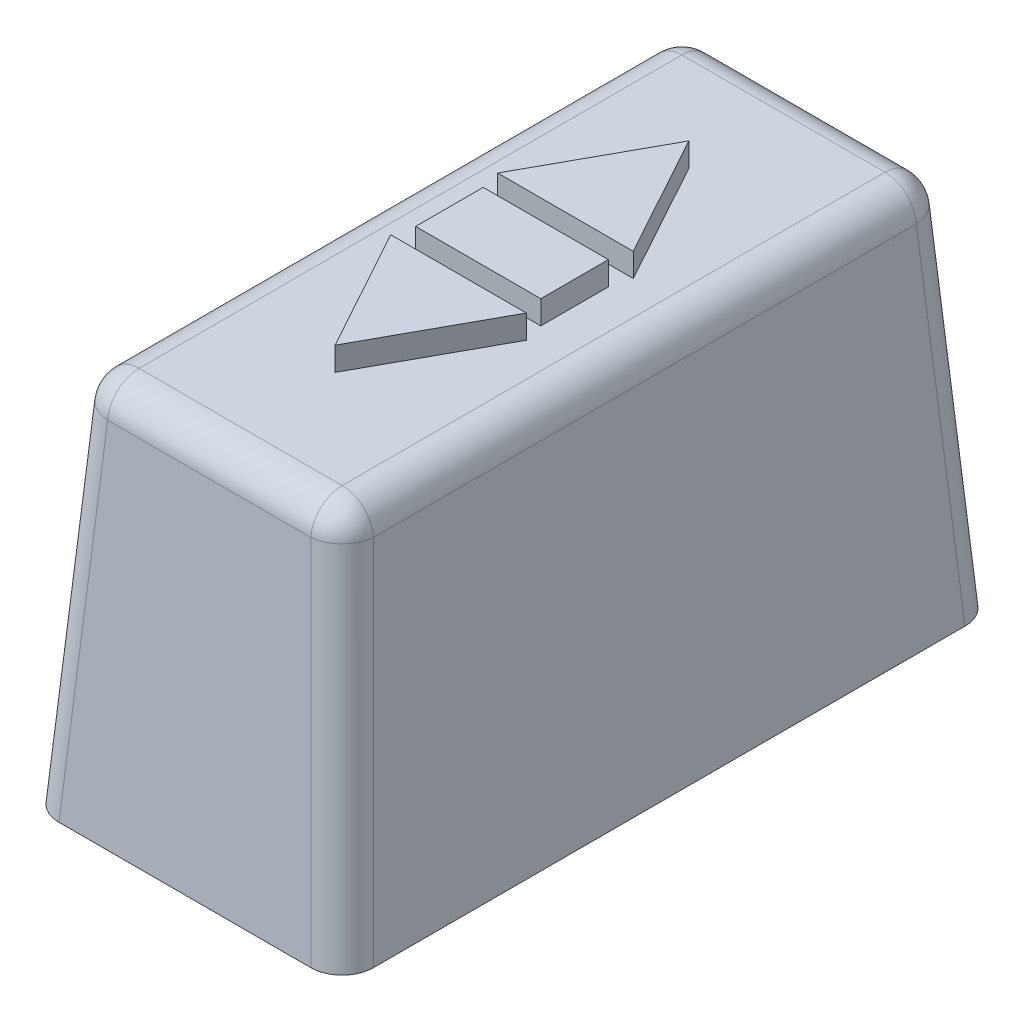
ISO-10303-21;
HEADER;
FILE_DESCRIPTION(('STEP AP214'),'2;1');
FILE_NAME('part.step','',(''),(''),'','','');
FILE_SCHEMA(('AUTOMOTIVE_DESIGN { 1 0 10303 214 1 1 1 1 }'));
ENDSEC;
DATA;
#1=APPLICATION_CONTEXT('core data for automotive mechanical design processes');
#2=APPLICATION_PROTOCOL_DEFINITION('international standard','automotive_design',2000,#1);
#3=PRODUCT_CONTEXT('',#1,'mechanical');
#4=PRODUCT('Part','Part','',(#3));
#5=PRODUCT_RELATED_PRODUCT_CATEGORY('part','',(#4));
#6=PRODUCT_DEFINITION_FORMATION('','',#4);
#7=PRODUCT_DEFINITION_CONTEXT('part definition',#1,'design');
#8=PRODUCT_DEFINITION('design','',#6,#7);
#9=PRODUCT_DEFINITION_SHAPE('','',#8);
#10=(LENGTH_UNIT() NAMED_UNIT(*) SI_UNIT(.MILLI.,.METRE.));
#11=(NAMED_UNIT(*) PLANE_ANGLE_UNIT() SI_UNIT($,.RADIAN.));
#12=(NAMED_UNIT(*) SI_UNIT($,.STERADIAN.) SOLID_ANGLE_UNIT());
#13=UNCERTAINTY_MEASURE_WITH_UNIT(LENGTH_MEASURE(1.E-05),#10,'distance_accuracy_value','');
#14=(GEOMETRIC_REPRESENTATION_CONTEXT(3) GLOBAL_UNCERTAINTY_ASSIGNED_CONTEXT((#13)) GLOBAL_UNIT_ASSIGNED_CONTEXT((#10,
#11,#12)) REPRESENTATION_CONTEXT('',''));
#15=CARTESIAN_POINT('',(0.,0.,0.));
#16=DIRECTION('',(0.,0.,1.));
#17=DIRECTION('',(1.,0.,0.));
#18=AXIS2_PLACEMENT_3D('',#15,#16,#17);
#19=CARTESIAN_POINT('',(0.,48.,0.));
#20=DIRECTION('',(0.,1.,0.));
#21=DIRECTION('',(0.,0.,1.));
#22=AXIS2_PLACEMENT_3D('',#19,#20,#21);
#23=PLANE('',#22);
#24=DIRECTION('',(0.,0.,1.));
#25=VECTOR('',#24,1.);
#26=CARTESIAN_POINT('',(12.9134526821608,48.,0.));
#27=LINE('',#26,#25);
#28=CARTESIAN_POINT('',(12.9134526821608,48.,34.5134526821608));
#29=VERTEX_POINT('',#28);
#30=CARTESIAN_POINT('',(12.9134526821608,48.,-34.5134526821608));
#31=VERTEX_POINT('',#30);
#32=EDGE_CURVE('E310',#29,#31,#27,.F.);
#33=ORIENTED_EDGE('',*,*,#32,.T.);
#34=DIRECTION('',(1.,0.,0.));
#35=VECTOR('',#34,1.);
#36=CARTESIAN_POINT('',(0.,48.,-34.5134526821608));
#37=LINE('',#36,#35);
#38=CARTESIAN_POINT('',(-12.9134526821608,48.,-34.5134526821608));
#39=VERTEX_POINT('',#38);
#40=EDGE_CURVE('E319',#31,#39,#37,.F.);
#41=ORIENTED_EDGE('',*,*,#40,.T.);
#42=DIRECTION('',(0.,0.,1.));
#43=VECTOR('',#42,1.);
#44=CARTESIAN_POINT('',(-12.9134526821608,48.,0.));
#45=LINE('',#44,#43);
#46=CARTESIAN_POINT('',(-12.9134526821608,48.,34.5134526821608));
#47=VERTEX_POINT('',#46);
#48=EDGE_CURVE('E316',#39,#47,#45,.T.);
#49=ORIENTED_EDGE('',*,*,#48,.T.);
#50=DIRECTION('',(1.,0.,0.));
#51=VECTOR('',#50,1.);
#52=CARTESIAN_POINT('',(0.,48.,34.5134526821608));
#53=LINE('',#52,#51);
#54=EDGE_CURVE('E313',#47,#29,#53,.T.);
#55=ORIENTED_EDGE('',*,*,#54,.T.);
#56=EDGE_LOOP('',(#33,#41,#49,#55));
#57=FACE_BOUND('',#56,.T.);
#58=DIRECTION('',(0.,0.,-1.));
#59=VECTOR('',#58,1.);
#60=CARTESIAN_POINT('',(-7.95831378719474,48.,0.));
#61=LINE('',#60,#59);
#62=CARTESIAN_POINT('',(-7.95831378719474,48.,4.3));
#63=VERTEX_POINT('',#62);
#64=CARTESIAN_POINT('',(-7.95831378719474,48.,-4.3));
#65=VERTEX_POINT('',#64);
#66=EDGE_CURVE('E199',#63,#65,#61,.T.);
#67=ORIENTED_EDGE('',*,*,#66,.T.);
#68=DIRECTION('',(-1.,0.,0.));
#69=VECTOR('',#68,1.);
#70=CARTESIAN_POINT('',(0.,48.,-4.3));
#71=LINE('',#70,#69);
#72=CARTESIAN_POINT('',(7.95831378719474,48.,-4.3));
#73=VERTEX_POINT('',#72);
#74=EDGE_CURVE('E240',#73,#65,#71,.T.);
#75=ORIENTED_EDGE('',*,*,#74,.F.);
#76=DIRECTION('',(0.,0.,-1.));
#77=VECTOR('',#76,1.);
#78=CARTESIAN_POINT('',(7.95831378719474,48.,0.));
#79=LINE('',#78,#77);
#80=CARTESIAN_POINT('',(7.95831378719474,48.,4.3));
#81=VERTEX_POINT('',#80);
#82=EDGE_CURVE('E244',#81,#73,#79,.T.);
#83=ORIENTED_EDGE('',*,*,#82,.F.);
#84=DIRECTION('',(-1.,0.,0.));
#85=VECTOR('',#84,1.);
#86=CARTESIAN_POINT('',(0.,48.,4.3));
#87=LINE('',#86,#85);
#88=EDGE_CURVE('E226',#81,#63,#87,.T.);
#89=ORIENTED_EDGE('',*,*,#88,.T.);
#90=EDGE_LOOP('',(#67,#75,#83,#89));
#91=FACE_BOUND('',#90,.T.);
#92=DIRECTION('',(0.481298204333065,0.,-0.876556922570216));
#93=VECTOR('',#92,1.);
#94=CARTESIAN_POINT('',(-9.49241863864714,48.,-5.21207913362023));
#95=LINE('',#94,#93);
#96=CARTESIAN_POINT('',(-8.62052607590218,48.,-6.8));
#97=VERTEX_POINT('',#96);
#98=CARTESIAN_POINT('',(0.,48.,-22.5));
#99=VERTEX_POINT('',#98);
#100=EDGE_CURVE('E254',#97,#99,#95,.T.);
#101=ORIENTED_EDGE('',*,*,#100,.T.);
#102=DIRECTION('',(0.481298204333064,0.,0.876556922570216));
#103=VECTOR('',#102,1.);
#104=CARTESIAN_POINT('',(9.49241863864715,48.,-5.21207913362023));
#105=LINE('',#104,#103);
#106=CARTESIAN_POINT('',(8.62052607590218,48.,-6.8));
#107=VERTEX_POINT('',#106);
#108=EDGE_CURVE('E279',#99,#107,#105,.T.);
#109=ORIENTED_EDGE('',*,*,#108,.T.);
#110=DIRECTION('',(-1.,0.,0.));
#111=VECTOR('',#110,1.);
#112=CARTESIAN_POINT('',(0.,48.,-6.8));
#113=LINE('',#112,#111);
#114=EDGE_CURVE('E268',#107,#97,#113,.T.);
#115=ORIENTED_EDGE('',*,*,#114,.T.);
#116=EDGE_LOOP('',(#101,#109,#115));
#117=FACE_BOUND('',#116,.T.);
#118=DIRECTION('',(-0.481298204333065,0.,-0.876556922570216));
#119=VECTOR('',#118,1.);
#120=CARTESIAN_POINT('',(-9.49241863864714,48.,5.21207913362023));
#121=LINE('',#120,#119);
#122=CARTESIAN_POINT('',(0.,48.,22.5));
#123=VERTEX_POINT('',#122);
#124=CARTESIAN_POINT('',(-8.62052607590217,48.,6.8));
#125=VERTEX_POINT('',#124);
#126=EDGE_CURVE('E212',#123,#125,#121,.T.);
#127=ORIENTED_EDGE('',*,*,#126,.T.);
#128=DIRECTION('',(-1.,0.,0.));
#129=VECTOR('',#128,1.);
#130=CARTESIAN_POINT('',(0.,48.,6.8));
#131=LINE('',#130,#129);
#132=CARTESIAN_POINT('',(8.62052607590218,48.,6.8));
#133=VERTEX_POINT('',#132);
#134=EDGE_CURVE('E195',#133,#125,#131,.T.);
#135=ORIENTED_EDGE('',*,*,#134,.F.);
#136=DIRECTION('',(-0.481298204333064,0.,0.876556922570216));
#137=VECTOR('',#136,1.);
#138=CARTESIAN_POINT('',(9.49241863864715,48.,5.21207913362023));
#139=LINE('',#138,#137);
#140=EDGE_CURVE('E189',#133,#123,#139,.T.);
#141=ORIENTED_EDGE('',*,*,#140,.T.);
#142=EDGE_LOOP('',(#127,#135,#141));
#143=FACE_BOUND('',#142,.T.);
#144=ADVANCED_FACE('F41',(#57,#91,#117,#143),#23,.T.);
#145=CARTESIAN_POINT('',(0.,0.,0.));
#146=DIRECTION('',(0.,1.,0.));
#147=DIRECTION('',(0.,0.,1.));
#148=AXIS2_PLACEMENT_3D('',#145,#146,#147);
#149=PLANE('',#148);
#150=DIRECTION('',(1.,0.,0.));
#151=VECTOR('',#150,1.);
#152=CARTESIAN_POINT('',(0.,0.,-41.6));
#153=LINE('',#152,#151);
#154=CARTESIAN_POINT('',(-16.0097437989605,0.,-41.6));
#155=VERTEX_POINT('',#154);
#156=CARTESIAN_POINT('',(16.0097437989605,0.,-41.6));
#157=VERTEX_POINT('',#156);
#158=EDGE_CURVE('E299',#155,#157,#153,.T.);
#159=ORIENTED_EDGE('',*,*,#158,.T.);
#160=CARTESIAN_POINT('',(15.9902324076752,0.,-37.5902324076751));
#161=DIRECTION('',(0.,1.,0.));
#162=DIRECTION('',(-0.707106781186548,0.,0.707106781186548));
#163=AXIS2_PLACEMENT_3D('',#160,#161,#162);
#164=ELLIPSE('',#163,4.01951144903391,4.);
#165=CARTESIAN_POINT('',(20.,0.,-37.6097437989605));
#166=VERTEX_POINT('',#165);
#167=EDGE_CURVE('E351',#157,#166,#164,.F.);
#168=ORIENTED_EDGE('',*,*,#167,.T.);
#169=DIRECTION('',(0.,0.,1.));
#170=VECTOR('',#169,1.);
#171=CARTESIAN_POINT('',(20.,0.,0.));
#172=LINE('',#171,#170);
#173=CARTESIAN_POINT('',(20.,0.,37.6097437989605));
#174=VERTEX_POINT('',#173);
#175=EDGE_CURVE('E288',#166,#174,#172,.T.);
#176=ORIENTED_EDGE('',*,*,#175,.T.);
#177=CARTESIAN_POINT('',(15.9902324076752,0.,37.5902324076751));
#178=DIRECTION('',(0.,1.,0.));
#179=DIRECTION('',(0.707106781186548,0.,0.707106781186548));
#180=AXIS2_PLACEMENT_3D('',#177,#178,#179);
#181=ELLIPSE('',#180,4.01951144903391,4.);
#182=CARTESIAN_POINT('',(16.0097437989605,0.,41.6));
#183=VERTEX_POINT('',#182);
#184=EDGE_CURVE('E342',#174,#183,#181,.F.);
#185=ORIENTED_EDGE('',*,*,#184,.T.);
#186=DIRECTION('',(1.,0.,0.));
#187=VECTOR('',#186,1.);
#188=CARTESIAN_POINT('',(0.,0.,41.6));
#189=LINE('',#188,#187);
#190=CARTESIAN_POINT('',(-16.0097437989605,0.,41.6));
#191=VERTEX_POINT('',#190);
#192=EDGE_CURVE('E307',#191,#183,#189,.T.);
#193=ORIENTED_EDGE('',*,*,#192,.F.);
#194=CARTESIAN_POINT('',(-15.9902324076751,0.,37.5902324076751));
#195=DIRECTION('',(0.,1.,0.));
#196=DIRECTION('',(-0.707106781186548,0.,0.707106781186548));
#197=AXIS2_PLACEMENT_3D('',#194,#195,#196);
#198=ELLIPSE('',#197,4.01951144903391,4.);
#199=CARTESIAN_POINT('',(-20.,0.,37.6097437989605));
#200=VERTEX_POINT('',#199);
#201=EDGE_CURVE('E345',#191,#200,#198,.F.);
#202=ORIENTED_EDGE('',*,*,#201,.T.);
#203=DIRECTION('',(0.,0.,1.));
#204=VECTOR('',#203,1.);
#205=CARTESIAN_POINT('',(-20.,0.,0.));
#206=LINE('',#205,#204);
#207=CARTESIAN_POINT('',(-20.,0.,-37.6097437989605));
#208=VERTEX_POINT('',#207);
#209=EDGE_CURVE('E303',#208,#200,#206,.T.);
#210=ORIENTED_EDGE('',*,*,#209,.F.);
#211=CARTESIAN_POINT('',(-15.9902324076751,0.,-37.5902324076751));
#212=DIRECTION('',(0.,1.,0.));
#213=DIRECTION('',(0.707106781186548,0.,0.707106781186548));
#214=AXIS2_PLACEMENT_3D('',#211,#212,#213);
#215=ELLIPSE('',#214,4.01951144903391,4.);
#216=EDGE_CURVE('E348',#208,#155,#215,.F.);
#217=ORIENTED_EDGE('',*,*,#216,.T.);
#218=EDGE_LOOP('',(#159,#168,#176,#185,#193,#202,#210,#217));
#219=FACE_BOUND('',#218,.T.);
#220=ADVANCED_FACE('F443',(#219),#149,.F.);
#221=CARTESIAN_POINT('',(0.,-2.35922392732846E-12,-41.6));
#222=DIRECTION('',(0.,-0.069756473744122,0.997564050259825));
#223=DIRECTION('',(1.,0.,0.));
#224=AXIS2_PLACEMENT_3D('',#221,#222,#223);
#225=PLANE('',#224);
#226=DIRECTION('',(-1.,0.,0.));
#227=VECTOR('',#226,1.);
#228=CARTESIAN_POINT('',(0.,44.2790258949765,-38.5037088832001));
#229=LINE('',#228,#227);
#230=CARTESIAN_POINT('',(-12.9134526821608,44.2790258949765,-38.5037088832001));
#231=VERTEX_POINT('',#230);
#232=CARTESIAN_POINT('',(12.9134526821608,44.2790258949765,-38.5037088832001));
#233=VERTEX_POINT('',#232);
#234=EDGE_CURVE('E326',#231,#233,#229,.F.);
#235=ORIENTED_EDGE('',*,*,#234,.T.);
#236=DIRECTION('',(0.0695873743166614,-0.995145815783509,-0.0695873743166614));
#237=VECTOR('',#236,1.);
#238=CARTESIAN_POINT('',(15.9322181729341,1.10866810414736,-41.5224743739734));
#239=LINE('',#238,#237);
#240=EDGE_CURVE('E330',#233,#157,#239,.T.);
#241=ORIENTED_EDGE('',*,*,#240,.T.);
#242=ORIENTED_EDGE('',*,*,#158,.F.);
#243=DIRECTION('',(-0.0695873743166614,-0.995145815783509,-0.0695873743166614));
#244=VECTOR('',#243,1.);
#245=CARTESIAN_POINT('',(-15.9322181729341,1.10866810414736,-41.5224743739734));
#246=LINE('',#245,#244);
#247=EDGE_CURVE('E323',#155,#231,#246,.F.);
#248=ORIENTED_EDGE('',*,*,#247,.T.);
#249=EDGE_LOOP('',(#235,#241,#242,#248));
#250=FACE_BOUND('',#249,.T.);
#251=ADVANCED_FACE('F475',(#250),#225,.F.);
#252=CARTESIAN_POINT('',(-16.6435130267115,48.,0.));
#253=DIRECTION('',(-0.997564050259825,0.069756473744122,0.));
#254=DIRECTION('',(0.,0.,-1.));
#255=AXIS2_PLACEMENT_3D('',#252,#253,#254);
#256=PLANE('',#255);
#257=DIRECTION('',(0.,0.,1.));
#258=VECTOR('',#257,1.);
#259=CARTESIAN_POINT('',(-16.9037088832001,44.2790258949765,0.));
#260=LINE('',#259,#258);
#261=CARTESIAN_POINT('',(-16.9037088832001,44.2790258949765,34.5134526821608));
#262=VERTEX_POINT('',#261);
#263=CARTESIAN_POINT('',(-16.9037088832001,44.2790258949765,-34.5134526821608));
#264=VERTEX_POINT('',#263);
#265=EDGE_CURVE('E357',#262,#264,#260,.F.);
#266=ORIENTED_EDGE('',*,*,#265,.T.);
#267=DIRECTION('',(0.0695873743166614,0.995145815783509,0.0695873743166614));
#268=VECTOR('',#267,1.);
#269=CARTESIAN_POINT('',(-16.4776449645983,50.3720237989278,-34.087388763559));
#270=LINE('',#269,#268);
#271=EDGE_CURVE('E360',#264,#208,#270,.F.);
#272=ORIENTED_EDGE('',*,*,#271,.T.);
#273=ORIENTED_EDGE('',*,*,#209,.T.);
#274=DIRECTION('',(-0.0695873743166614,-0.995145815783509,0.0695873743166614));
#275=VECTOR('',#274,1.);
#276=CARTESIAN_POINT('',(-16.4776449645983,50.3720237989278,34.087388763559));
#277=LINE('',#276,#275);
#278=EDGE_CURVE('E354',#200,#262,#277,.F.);
#279=ORIENTED_EDGE('',*,*,#278,.T.);
#280=EDGE_LOOP('',(#266,#272,#273,#279));
#281=FACE_BOUND('',#280,.T.);
#282=ADVANCED_FACE('F468',(#281),#256,.T.);
#283=CARTESIAN_POINT('',(20.,-2.35922392732846E-12,0.));
#284=DIRECTION('',(-0.997564050259825,-0.069756473744122,0.));
#285=DIRECTION('',(0.,0.,1.));
#286=AXIS2_PLACEMENT_3D('',#283,#284,#285);
#287=PLANE('',#286);
#288=ORIENTED_EDGE('',*,*,#175,.F.);
#289=DIRECTION('',(0.0695873743166614,-0.995145815783509,-0.0695873743166614));
#290=VECTOR('',#289,1.);
#291=CARTESIAN_POINT('',(19.8178784764248,2.60445912681122,-37.4276222753855));
#292=LINE('',#291,#290);
#293=CARTESIAN_POINT('',(16.9037088832001,44.2790258949765,-34.5134526821608));
#294=VERTEX_POINT('',#293);
#295=EDGE_CURVE('E339',#166,#294,#292,.F.);
#296=ORIENTED_EDGE('',*,*,#295,.T.);
#297=DIRECTION('',(0.,0.,-1.));
#298=VECTOR('',#297,1.);
#299=CARTESIAN_POINT('',(16.9037088832001,44.2790258949765,0.));
#300=LINE('',#299,#298);
#301=CARTESIAN_POINT('',(16.9037088832001,44.2790258949765,34.5134526821608));
#302=VERTEX_POINT('',#301);
#303=EDGE_CURVE('E333',#294,#302,#300,.F.);
#304=ORIENTED_EDGE('',*,*,#303,.T.);
#305=DIRECTION('',(-0.0695873743166614,0.995145815783509,-0.0695873743166614));
#306=VECTOR('',#305,1.);
#307=CARTESIAN_POINT('',(19.8178784764248,2.60445912681122,37.4276222753855));
#308=LINE('',#307,#306);
#309=EDGE_CURVE('E336',#302,#174,#308,.F.);
#310=ORIENTED_EDGE('',*,*,#309,.T.);
#311=EDGE_LOOP('',(#288,#296,#304,#310));
#312=FACE_BOUND('',#311,.T.);
#313=ADVANCED_FACE('F448',(#312),#287,.F.);
#314=CARTESIAN_POINT('',(0.,48.,38.2435130267115));
#315=DIRECTION('',(0.,0.069756473744122,0.997564050259825));
#316=DIRECTION('',(-1.,0.,0.));
#317=AXIS2_PLACEMENT_3D('',#314,#315,#316);
#318=PLANE('',#317);
#319=DIRECTION('',(1.,0.,0.));
#320=VECTOR('',#319,1.);
#321=CARTESIAN_POINT('',(0.,44.2790258949765,38.5037088832001));
#322=LINE('',#321,#320);
#323=CARTESIAN_POINT('',(12.9134526821608,44.2790258949765,38.5037088832001));
#324=VERTEX_POINT('',#323);
#325=CARTESIAN_POINT('',(-12.9134526821608,44.2790258949765,38.5037088832001));
#326=VERTEX_POINT('',#325);
#327=EDGE_CURVE('E51',#324,#326,#322,.F.);
#328=ORIENTED_EDGE('',*,*,#327,.T.);
#329=DIRECTION('',(-0.0695873743166614,-0.995145815783509,0.0695873743166614));
#330=VECTOR('',#329,1.);
#331=CARTESIAN_POINT('',(-12.5919846611077,48.8762327762639,38.1822408621469));
#332=LINE('',#331,#330);
#333=EDGE_CURVE('E11',#326,#191,#332,.T.);
#334=ORIENTED_EDGE('',*,*,#333,.T.);
#335=ORIENTED_EDGE('',*,*,#192,.T.);
#336=DIRECTION('',(0.0695873743166614,-0.995145815783509,0.0695873743166614));
#337=VECTOR('',#336,1.);
#338=CARTESIAN_POINT('',(12.5919846611077,48.8762327762639,38.1822408621469));
#339=LINE('',#338,#337);
#340=EDGE_CURVE('E62',#183,#324,#339,.F.);
#341=ORIENTED_EDGE('',*,*,#340,.T.);
#342=EDGE_LOOP('',(#328,#334,#335,#341));
#343=FACE_BOUND('',#342,.T.);
#344=ADVANCED_FACE('F441',(#343),#318,.T.);
#345=CARTESIAN_POINT('',(-9.49241863864714,51.,-5.21207913362023));
#346=DIRECTION('',(-0.876556922570216,0.,-0.481298204333065));
#347=DIRECTION('',(-0.481298204333065,0.,0.876556922570216));
#348=AXIS2_PLACEMENT_3D('',#345,#346,#347);
#349=PLANE('',#348);
#350=ORIENTED_EDGE('',*,*,#100,.F.);
#351=DIRECTION('',(0.,-1.,0.));
#352=VECTOR('',#351,1.);
#353=CARTESIAN_POINT('',(-8.62052607590218,51.,-6.8));
#354=LINE('',#353,#352);
#355=CARTESIAN_POINT('',(-8.62052607590218,51.,-6.8));
#356=VERTEX_POINT('',#355);
#357=EDGE_CURVE('E284',#356,#97,#354,.T.);
#358=ORIENTED_EDGE('',*,*,#357,.F.);
#359=DIRECTION('',(0.481298204333065,0.,-0.876556922570216));
#360=VECTOR('',#359,1.);
#361=CARTESIAN_POINT('',(-9.49241863864714,51.,-5.21207913362023));
#362=LINE('',#361,#360);
#363=CARTESIAN_POINT('',(0.,51.,-22.5));
#364=VERTEX_POINT('',#363);
#365=EDGE_CURVE('E263',#356,#364,#362,.T.);
#366=ORIENTED_EDGE('',*,*,#365,.T.);
#367=DIRECTION('',(0.,-1.,0.));
#368=VECTOR('',#367,1.);
#369=CARTESIAN_POINT('',(0.,51.,-22.5));
#370=LINE('',#369,#368);
#371=EDGE_CURVE('E276',#364,#99,#370,.T.);
#372=ORIENTED_EDGE('',*,*,#371,.T.);
#373=EDGE_LOOP('',(#350,#358,#366,#372));
#374=FACE_BOUND('',#373,.T.);
#375=ADVANCED_FACE('F491',(#374),#349,.T.);
#376=CARTESIAN_POINT('',(0.,51.,-6.8));
#377=DIRECTION('',(0.,0.,1.));
#378=DIRECTION('',(1.,0.,0.));
#379=AXIS2_PLACEMENT_3D('',#376,#377,#378);
#380=PLANE('',#379);
#381=ORIENTED_EDGE('',*,*,#114,.F.);
#382=DIRECTION('',(0.,-1.,0.));
#383=VECTOR('',#382,1.);
#384=CARTESIAN_POINT('',(8.62052607590218,51.,-6.8));
#385=LINE('',#384,#383);
#386=CARTESIAN_POINT('',(8.62052607590218,51.,-6.8));
#387=VERTEX_POINT('',#386);
#388=EDGE_CURVE('E289',#387,#107,#385,.T.);
#389=ORIENTED_EDGE('',*,*,#388,.F.);
#390=DIRECTION('',(-1.,0.,0.));
#391=VECTOR('',#390,1.);
#392=CARTESIAN_POINT('',(0.,51.,-6.8));
#393=LINE('',#392,#391);
#394=EDGE_CURVE('E272',#387,#356,#393,.T.);
#395=ORIENTED_EDGE('',*,*,#394,.T.);
#396=ORIENTED_EDGE('',*,*,#357,.T.);
#397=EDGE_LOOP('',(#381,#389,#395,#396));
#398=FACE_BOUND('',#397,.T.);
#399=ADVANCED_FACE('F523',(#398),#380,.T.);
#400=CARTESIAN_POINT('',(9.49241863864715,51.,-5.21207913362023));
#401=DIRECTION('',(0.876556922570216,0.,-0.481298204333064));
#402=DIRECTION('',(-0.481298204333064,0.,-0.876556922570216));
#403=AXIS2_PLACEMENT_3D('',#400,#401,#402);
#404=PLANE('',#403);
#405=ORIENTED_EDGE('',*,*,#108,.F.);
#406=ORIENTED_EDGE('',*,*,#371,.F.);
#407=DIRECTION('',(0.481298204333064,0.,0.876556922570216));
#408=VECTOR('',#407,1.);
#409=CARTESIAN_POINT('',(9.49241863864715,51.,-5.21207913362023));
#410=LINE('',#409,#408);
#411=EDGE_CURVE('E267',#364,#387,#410,.T.);
#412=ORIENTED_EDGE('',*,*,#411,.T.);
#413=ORIENTED_EDGE('',*,*,#388,.T.);
#414=EDGE_LOOP('',(#405,#406,#412,#413));
#415=FACE_BOUND('',#414,.T.);
#416=ADVANCED_FACE('F530',(#415),#404,.T.);
#417=CARTESIAN_POINT('',(0.,51.,0.));
#418=DIRECTION('',(0.,1.,0.));
#419=DIRECTION('',(0.,0.,1.));
#420=AXIS2_PLACEMENT_3D('',#417,#418,#419);
#421=PLANE('',#420);
#422=ORIENTED_EDGE('',*,*,#365,.F.);
#423=ORIENTED_EDGE('',*,*,#394,.F.);
#424=ORIENTED_EDGE('',*,*,#411,.F.);
#425=EDGE_LOOP('',(#422,#423,#424));
#426=FACE_BOUND('',#425,.T.);
#427=ADVANCED_FACE('F538',(#426),#421,.T.);
#428=CARTESIAN_POINT('',(-7.95831378719474,51.,0.));
#429=DIRECTION('',(-1.,0.,0.));
#430=DIRECTION('',(0.,0.,1.));
#431=AXIS2_PLACEMENT_3D('',#428,#429,#430);
#432=PLANE('',#431);
#433=ORIENTED_EDGE('',*,*,#66,.F.);
#434=DIRECTION('',(0.,-1.,0.));
#435=VECTOR('',#434,1.);
#436=CARTESIAN_POINT('',(-7.95831378719474,51.,4.3));
#437=LINE('',#436,#435);
#438=CARTESIAN_POINT('',(-7.95831378719474,51.,4.3));
#439=VERTEX_POINT('',#438);
#440=EDGE_CURVE('E251',#439,#63,#437,.T.);
#441=ORIENTED_EDGE('',*,*,#440,.F.);
#442=DIRECTION('',(0.,0.,-1.));
#443=VECTOR('',#442,1.);
#444=CARTESIAN_POINT('',(-7.95831378719474,51.,0.));
#445=LINE('',#444,#443);
#446=CARTESIAN_POINT('',(-7.95831378719474,51.,-4.3));
#447=VERTEX_POINT('',#446);
#448=EDGE_CURVE('E221',#439,#447,#445,.T.);
#449=ORIENTED_EDGE('',*,*,#448,.T.);
#450=DIRECTION('',(0.,-1.,0.));
#451=VECTOR('',#450,1.);
#452=CARTESIAN_POINT('',(-7.95831378719474,51.,-4.3));
#453=LINE('',#452,#451);
#454=EDGE_CURVE('E236',#447,#65,#453,.T.);
#455=ORIENTED_EDGE('',*,*,#454,.T.);
#456=EDGE_LOOP('',(#433,#441,#449,#455));
#457=FACE_BOUND('',#456,.T.);
#458=ADVANCED_FACE('F545',(#457),#432,.T.);
#459=CARTESIAN_POINT('',(0.,51.,4.3));
#460=DIRECTION('',(0.,0.,1.));
#461=DIRECTION('',(1.,0.,0.));
#462=AXIS2_PLACEMENT_3D('',#459,#460,#461);
#463=PLANE('',#462);
#464=ORIENTED_EDGE('',*,*,#88,.F.);
#465=DIRECTION('',(0.,-1.,0.));
#466=VECTOR('',#465,1.);
#467=CARTESIAN_POINT('',(7.95831378719474,51.,4.3));
#468=LINE('',#467,#466);
#469=CARTESIAN_POINT('',(7.95831378719474,51.,4.3));
#470=VERTEX_POINT('',#469);
#471=EDGE_CURVE('E255',#470,#81,#468,.T.);
#472=ORIENTED_EDGE('',*,*,#471,.F.);
#473=DIRECTION('',(-1.,0.,0.));
#474=VECTOR('',#473,1.);
#475=CARTESIAN_POINT('',(0.,51.,4.3));
#476=LINE('',#475,#474);
#477=EDGE_CURVE('E232',#470,#439,#476,.T.);
#478=ORIENTED_EDGE('',*,*,#477,.T.);
#479=ORIENTED_EDGE('',*,*,#440,.T.);
#480=EDGE_LOOP('',(#464,#472,#478,#479));
#481=FACE_BOUND('',#480,.T.);
#482=ADVANCED_FACE('F553',(#481),#463,.T.);
#483=CARTESIAN_POINT('',(7.95831378719474,51.,0.));
#484=DIRECTION('',(-1.,0.,0.));
#485=DIRECTION('',(0.,0.,1.));
#486=AXIS2_PLACEMENT_3D('',#483,#484,#485);
#487=PLANE('',#486);
#488=ORIENTED_EDGE('',*,*,#82,.T.);
#489=DIRECTION('',(0.,-1.,0.));
#490=VECTOR('',#489,1.);
#491=CARTESIAN_POINT('',(7.95831378719474,51.,-4.3));
#492=LINE('',#491,#490);
#493=CARTESIAN_POINT('',(7.95831378719474,51.,-4.3));
#494=VERTEX_POINT('',#493);
#495=EDGE_CURVE('E258',#494,#73,#492,.T.);
#496=ORIENTED_EDGE('',*,*,#495,.F.);
#497=DIRECTION('',(0.,0.,-1.));
#498=VECTOR('',#497,1.);
#499=CARTESIAN_POINT('',(7.95831378719474,51.,0.));
#500=LINE('',#499,#498);
#501=EDGE_CURVE('E229',#470,#494,#500,.T.);
#502=ORIENTED_EDGE('',*,*,#501,.F.);
#503=ORIENTED_EDGE('',*,*,#471,.T.);
#504=EDGE_LOOP('',(#488,#496,#502,#503));
#505=FACE_BOUND('',#504,.T.);
#506=ADVANCED_FACE('F561',(#505),#487,.F.);
#507=CARTESIAN_POINT('',(0.,51.,-4.3));
#508=DIRECTION('',(0.,0.,1.));
#509=DIRECTION('',(1.,0.,0.));
#510=AXIS2_PLACEMENT_3D('',#507,#508,#509);
#511=PLANE('',#510);
#512=ORIENTED_EDGE('',*,*,#74,.T.);
#513=ORIENTED_EDGE('',*,*,#454,.F.);
#514=DIRECTION('',(-1.,0.,0.));
#515=VECTOR('',#514,1.);
#516=CARTESIAN_POINT('',(0.,51.,-4.3));
#517=LINE('',#516,#515);
#518=EDGE_CURVE('E225',#494,#447,#517,.T.);
#519=ORIENTED_EDGE('',*,*,#518,.F.);
#520=ORIENTED_EDGE('',*,*,#495,.T.);
#521=EDGE_LOOP('',(#512,#513,#519,#520));
#522=FACE_BOUND('',#521,.T.);
#523=ADVANCED_FACE('F569',(#522),#511,.F.);
#524=CARTESIAN_POINT('',(0.,51.,0.));
#525=DIRECTION('',(0.,1.,0.));
#526=DIRECTION('',(0.,0.,1.));
#527=AXIS2_PLACEMENT_3D('',#524,#525,#526);
#528=PLANE('',#527);
#529=ORIENTED_EDGE('',*,*,#448,.F.);
#530=ORIENTED_EDGE('',*,*,#477,.F.);
#531=ORIENTED_EDGE('',*,*,#501,.T.);
#532=ORIENTED_EDGE('',*,*,#518,.T.);
#533=EDGE_LOOP('',(#529,#530,#531,#532));
#534=FACE_BOUND('',#533,.T.);
#535=ADVANCED_FACE('F577',(#534),#528,.T.);
#536=CARTESIAN_POINT('',(0.,51.,6.8));
#537=DIRECTION('',(0.,0.,1.));
#538=DIRECTION('',(1.,0.,0.));
#539=AXIS2_PLACEMENT_3D('',#536,#537,#538);
#540=PLANE('',#539);
#541=ORIENTED_EDGE('',*,*,#134,.T.);
#542=DIRECTION('',(0.,-1.,0.));
#543=VECTOR('',#542,1.);
#544=CARTESIAN_POINT('',(-8.62052607590217,51.,6.8));
#545=LINE('',#544,#543);
#546=CARTESIAN_POINT('',(-8.62052607590217,51.,6.8));
#547=VERTEX_POINT('',#546);
#548=EDGE_CURVE('E193',#547,#125,#545,.T.);
#549=ORIENTED_EDGE('',*,*,#548,.F.);
#550=DIRECTION('',(-1.,0.,0.));
#551=VECTOR('',#550,1.);
#552=CARTESIAN_POINT('',(0.,51.,6.8));
#553=LINE('',#552,#551);
#554=CARTESIAN_POINT('',(8.62052607590218,51.,6.8));
#555=VERTEX_POINT('',#554);
#556=EDGE_CURVE('E179',#555,#547,#553,.T.);
#557=ORIENTED_EDGE('',*,*,#556,.F.);
#558=DIRECTION('',(0.,-1.,0.));
#559=VECTOR('',#558,1.);
#560=CARTESIAN_POINT('',(8.62052607590218,51.,6.8));
#561=LINE('',#560,#559);
#562=EDGE_CURVE('E207',#555,#133,#561,.T.);
#563=ORIENTED_EDGE('',*,*,#562,.T.);
#564=EDGE_LOOP('',(#541,#549,#557,#563));
#565=FACE_BOUND('',#564,.T.);
#566=ADVANCED_FACE('F194',(#565),#540,.F.);
#567=CARTESIAN_POINT('',(-9.49241863864714,51.,5.21207913362023));
#568=DIRECTION('',(-0.876556922570216,0.,0.481298204333065));
#569=DIRECTION('',(0.481298204333065,0.,0.876556922570216));
#570=AXIS2_PLACEMENT_3D('',#567,#568,#569);
#571=PLANE('',#570);
#572=ORIENTED_EDGE('',*,*,#126,.F.);
#573=DIRECTION('',(0.,-1.,0.));
#574=VECTOR('',#573,1.);
#575=CARTESIAN_POINT('',(0.,51.,22.5));
#576=LINE('',#575,#574);
#577=CARTESIAN_POINT('',(0.,51.,22.5));
#578=VERTEX_POINT('',#577);
#579=EDGE_CURVE('E200',#578,#123,#576,.T.);
#580=ORIENTED_EDGE('',*,*,#579,.F.);
#581=DIRECTION('',(-0.481298204333065,0.,-0.876556922570216));
#582=VECTOR('',#581,1.);
#583=CARTESIAN_POINT('',(-9.49241863864714,51.,5.21207913362023));
#584=LINE('',#583,#582);
#585=EDGE_CURVE('E183',#578,#547,#584,.T.);
#586=ORIENTED_EDGE('',*,*,#585,.T.);
#587=ORIENTED_EDGE('',*,*,#548,.T.);
#588=EDGE_LOOP('',(#572,#580,#586,#587));
#589=FACE_BOUND('',#588,.T.);
#590=ADVANCED_FACE('F202',(#589),#571,.T.);
#591=CARTESIAN_POINT('',(9.49241863864715,51.,5.21207913362023));
#592=DIRECTION('',(0.876556922570216,0.,0.481298204333064));
#593=DIRECTION('',(0.481298204333064,0.,-0.876556922570216));
#594=AXIS2_PLACEMENT_3D('',#591,#592,#593);
#595=PLANE('',#594);
#596=ORIENTED_EDGE('',*,*,#140,.F.);
#597=ORIENTED_EDGE('',*,*,#562,.F.);
#598=DIRECTION('',(-0.481298204333064,0.,0.876556922570216));
#599=VECTOR('',#598,1.);
#600=CARTESIAN_POINT('',(9.49241863864715,51.,5.21207913362023));
#601=LINE('',#600,#599);
#602=EDGE_CURVE('E185',#555,#578,#601,.T.);
#603=ORIENTED_EDGE('',*,*,#602,.T.);
#604=ORIENTED_EDGE('',*,*,#579,.T.);
#605=EDGE_LOOP('',(#596,#597,#603,#604));
#606=FACE_BOUND('',#605,.T.);
#607=ADVANCED_FACE('F598',(#606),#595,.T.);
#608=CARTESIAN_POINT('',(0.,51.,0.));
#609=DIRECTION('',(0.,-1.,0.));
#610=DIRECTION('',(0.,0.,-1.));
#611=AXIS2_PLACEMENT_3D('',#608,#609,#610);
#612=PLANE('',#611);
#613=ORIENTED_EDGE('',*,*,#556,.T.);
#614=ORIENTED_EDGE('',*,*,#585,.F.);
#615=ORIENTED_EDGE('',*,*,#602,.F.);
#616=EDGE_LOOP('',(#613,#614,#615));
#617=FACE_BOUND('',#616,.T.);
#618=ADVANCED_FACE('F181',(#617),#612,.F.);
#619=CARTESIAN_POINT('',(12.5919846611077,48.5972068812874,34.1919846611076));
#620=DIRECTION('',(0.0695873743166614,-0.995145815783509,0.0695873743166614));
#621=DIRECTION('',(0.,-0.069756473744122,-0.997564050259824));
#622=AXIS2_PLACEMENT_3D('',#619,#620,#621);
#623=CYLINDRICAL_SURFACE('',#622,4.);
#624=ORIENTED_EDGE('',*,*,#184,.F.);
#625=ORIENTED_EDGE('',*,*,#309,.F.);
#626=CARTESIAN_POINT('',(12.9134526821608,44.,34.5134526821608));
#627=DIRECTION('',(-0.0695873743166621,0.995145815783509,-0.0695873743166621));
#628=DIRECTION('',(-0.997564050259824,-0.0697564737441227,0.));
#629=AXIS2_PLACEMENT_3D('',#626,#627,#628);
#630=CIRCLE('',#629,4.);
#631=EDGE_CURVE('E45',#324,#302,#630,.T.);
#632=ORIENTED_EDGE('',*,*,#631,.F.);
#633=ORIENTED_EDGE('',*,*,#340,.F.);
#634=EDGE_LOOP('',(#624,#625,#632,#633));
#635=FACE_BOUND('',#634,.T.);
#636=ADVANCED_FACE('F43',(#635),#623,.T.);
#637=CARTESIAN_POINT('',(0.,44.,34.5134526821608));
#638=DIRECTION('',(1.,0.,0.));
#639=DIRECTION('',(0.,0.,-1.));
#640=AXIS2_PLACEMENT_3D('',#637,#638,#639);
#641=CYLINDRICAL_SURFACE('',#640,4.);
#642=CARTESIAN_POINT('',(-12.9134526821608,44.,34.5134526821608));
#643=DIRECTION('',(-1.,0.,0.));
#644=DIRECTION('',(0.,-1.,0.));
#645=AXIS2_PLACEMENT_3D('',#642,#643,#644);
#646=CIRCLE('',#645,4.);
#647=EDGE_CURVE('E401',#326,#47,#646,.T.);
#648=ORIENTED_EDGE('',*,*,#647,.F.);
#649=ORIENTED_EDGE('',*,*,#327,.F.);
#650=CARTESIAN_POINT('',(12.9134526821608,44.,34.5134526821608));
#651=DIRECTION('',(1.,0.,0.));
#652=DIRECTION('',(0.,0.,-1.));
#653=AXIS2_PLACEMENT_3D('',#650,#651,#652);
#654=CIRCLE('',#653,4.);
#655=EDGE_CURVE('E404',#29,#324,#654,.T.);
#656=ORIENTED_EDGE('',*,*,#655,.F.);
#657=ORIENTED_EDGE('',*,*,#54,.F.);
#658=EDGE_LOOP('',(#648,#649,#656,#657));
#659=FACE_BOUND('',#658,.T.);
#660=ADVANCED_FACE('F430',(#659),#641,.T.);
#661=CARTESIAN_POINT('',(-12.5919846611077,48.5972068812874,34.1919846611076));
#662=DIRECTION('',(-0.0695873743166614,-0.995145815783509,0.0695873743166614));
#663=DIRECTION('',(0.,-0.069756473744122,-0.997564050259824));
#664=AXIS2_PLACEMENT_3D('',#661,#662,#663);
#665=CYLINDRICAL_SURFACE('',#664,4.);
#666=ORIENTED_EDGE('',*,*,#201,.F.);
#667=ORIENTED_EDGE('',*,*,#333,.F.);
#668=CARTESIAN_POINT('',(-12.9134526821608,44.,34.5134526821608));
#669=DIRECTION('',(0.0695873743166621,0.995145815783509,-0.0695873743166619));
#670=DIRECTION('',(-0.997564050259824,0.0697564737441227,0.));
#671=AXIS2_PLACEMENT_3D('',#668,#669,#670);
#672=CIRCLE('',#671,4.);
#673=EDGE_CURVE('E397',#262,#326,#672,.T.);
#674=ORIENTED_EDGE('',*,*,#673,.F.);
#675=ORIENTED_EDGE('',*,*,#278,.F.);
#676=EDGE_LOOP('',(#666,#667,#674,#675));
#677=FACE_BOUND('',#676,.T.);
#678=ADVANCED_FACE('F439',(#677),#665,.T.);
#679=CARTESIAN_POINT('',(12.9134526821608,44.,34.5134526821608));
#680=DIRECTION('',(0.,1.,0.));
#681=DIRECTION('',(0.,0.,1.));
#682=AXIS2_PLACEMENT_3D('',#679,#680,#681);
#683=SPHERICAL_SURFACE('',#682,4.);
#684=ORIENTED_EDGE('',*,*,#655,.T.);
#685=ORIENTED_EDGE('',*,*,#631,.T.);
#686=CARTESIAN_POINT('',(12.9134526821608,44.,34.5134526821608));
#687=DIRECTION('',(0.,0.,1.));
#688=DIRECTION('',(0.,-1.,0.));
#689=AXIS2_PLACEMENT_3D('',#686,#687,#688);
#690=CIRCLE('',#689,4.);
#691=EDGE_CURVE('E393',#29,#302,#690,.F.);
#692=ORIENTED_EDGE('',*,*,#691,.F.);
#693=EDGE_LOOP('',(#684,#685,#692));
#694=FACE_BOUND('',#693,.T.);
#695=ADVANCED_FACE('F413',(#694),#683,.T.);
#696=CARTESIAN_POINT('',(-12.9134526821608,44.,34.5134526821608));
#697=DIRECTION('',(0.,1.,0.));
#698=DIRECTION('',(0.,0.,1.));
#699=AXIS2_PLACEMENT_3D('',#696,#697,#698);
#700=SPHERICAL_SURFACE('',#699,4.);
#701=ORIENTED_EDGE('',*,*,#673,.T.);
#702=ORIENTED_EDGE('',*,*,#647,.T.);
#703=CARTESIAN_POINT('',(-12.9134526821608,44.,34.5134526821608));
#704=DIRECTION('',(0.,0.,1.));
#705=DIRECTION('',(1.,0.,0.));
#706=AXIS2_PLACEMENT_3D('',#703,#704,#705);
#707=CIRCLE('',#706,4.);
#708=EDGE_CURVE('E389',#262,#47,#707,.F.);
#709=ORIENTED_EDGE('',*,*,#708,.F.);
#710=EDGE_LOOP('',(#701,#702,#709));
#711=FACE_BOUND('',#710,.T.);
#712=ADVANCED_FACE('F434',(#711),#700,.T.);
#713=CARTESIAN_POINT('',(15.8276222753855,2.32543323183474,-37.4276222753855));
#714=DIRECTION('',(-0.0695873743166614,0.995145815783509,0.0695873743166614));
#715=DIRECTION('',(0.,-0.069756473744122,0.997564050259824));
#716=AXIS2_PLACEMENT_3D('',#713,#714,#715);
#717=CYLINDRICAL_SURFACE('',#716,4.);
#718=ORIENTED_EDGE('',*,*,#167,.F.);
#719=ORIENTED_EDGE('',*,*,#240,.F.);
#720=CARTESIAN_POINT('',(12.9134526821608,44.,-34.5134526821608));
#721=DIRECTION('',(-0.0695873743166621,0.995145815783509,0.0695873743166619));
#722=DIRECTION('',(-0.997564050259824,-0.0697564737441227,0.));
#723=AXIS2_PLACEMENT_3D('',#720,#721,#722);
#724=CIRCLE('',#723,4.);
#725=EDGE_CURVE('E385',#294,#233,#724,.T.);
#726=ORIENTED_EDGE('',*,*,#725,.F.);
#727=ORIENTED_EDGE('',*,*,#295,.F.);
#728=EDGE_LOOP('',(#718,#719,#726,#727));
#729=FACE_BOUND('',#728,.T.);
#730=ADVANCED_FACE('F452',(#729),#717,.T.);
#731=CARTESIAN_POINT('',(12.9134526821608,44.,0.));
#732=DIRECTION('',(0.,0.,1.));
#733=DIRECTION('',(1.,0.,0.));
#734=AXIS2_PLACEMENT_3D('',#731,#732,#733);
#735=CYLINDRICAL_SURFACE('',#734,4.);
#736=ORIENTED_EDGE('',*,*,#691,.T.);
#737=ORIENTED_EDGE('',*,*,#303,.F.);
#738=CARTESIAN_POINT('',(12.9134526821608,44.,-34.5134526821608));
#739=DIRECTION('',(0.,0.,-1.));
#740=DIRECTION('',(-1.,0.,0.));
#741=AXIS2_PLACEMENT_3D('',#738,#739,#740);
#742=CIRCLE('',#741,4.);
#743=EDGE_CURVE('E381',#31,#294,#742,.T.);
#744=ORIENTED_EDGE('',*,*,#743,.F.);
#745=ORIENTED_EDGE('',*,*,#32,.F.);
#746=EDGE_LOOP('',(#736,#737,#744,#745));
#747=FACE_BOUND('',#746,.T.);
#748=ADVANCED_FACE('F419',(#747),#735,.T.);
#749=CARTESIAN_POINT('',(-12.9134526821608,44.,0.));
#750=DIRECTION('',(0.,0.,1.));
#751=DIRECTION('',(1.,0.,0.));
#752=AXIS2_PLACEMENT_3D('',#749,#750,#751);
#753=CYLINDRICAL_SURFACE('',#752,4.);
#754=ORIENTED_EDGE('',*,*,#708,.T.);
#755=ORIENTED_EDGE('',*,*,#48,.F.);
#756=CARTESIAN_POINT('',(-12.9134526821608,44.,-34.5134526821608));
#757=DIRECTION('',(0.,0.,-1.));
#758=DIRECTION('',(-1.,0.,0.));
#759=AXIS2_PLACEMENT_3D('',#756,#757,#758);
#760=CIRCLE('',#759,4.);
#761=EDGE_CURVE('E377',#264,#39,#760,.T.);
#762=ORIENTED_EDGE('',*,*,#761,.F.);
#763=ORIENTED_EDGE('',*,*,#265,.F.);
#764=EDGE_LOOP('',(#754,#755,#762,#763));
#765=FACE_BOUND('',#764,.T.);
#766=ADVANCED_FACE('F465',(#765),#753,.T.);
#767=CARTESIAN_POINT('',(-12.487388763559,50.0929979039513,-34.087388763559));
#768=DIRECTION('',(0.0695873743166614,0.995145815783509,0.0695873743166614));
#769=DIRECTION('',(0.,-0.069756473744122,0.997564050259824));
#770=AXIS2_PLACEMENT_3D('',#767,#768,#769);
#771=CYLINDRICAL_SURFACE('',#770,4.);
#772=ORIENTED_EDGE('',*,*,#216,.F.);
#773=ORIENTED_EDGE('',*,*,#271,.F.);
#774=CARTESIAN_POINT('',(-12.9134526821608,44.,-34.5134526821608));
#775=DIRECTION('',(0.0695873743166621,0.995145815783509,0.0695873743166621));
#776=DIRECTION('',(-0.997564050259824,0.0697564737441227,0.));
#777=AXIS2_PLACEMENT_3D('',#774,#775,#776);
#778=CIRCLE('',#777,4.);
#779=EDGE_CURVE('E373',#231,#264,#778,.T.);
#780=ORIENTED_EDGE('',*,*,#779,.F.);
#781=ORIENTED_EDGE('',*,*,#247,.F.);
#782=EDGE_LOOP('',(#772,#773,#780,#781));
#783=FACE_BOUND('',#782,.T.);
#784=ADVANCED_FACE('F471',(#783),#771,.T.);
#785=CARTESIAN_POINT('',(12.9134526821608,44.,-34.5134526821608));
#786=DIRECTION('',(0.,1.,0.));
#787=DIRECTION('',(-1.,0.,0.));
#788=AXIS2_PLACEMENT_3D('',#785,#786,#787);
#789=SPHERICAL_SURFACE('',#788,4.);
#790=ORIENTED_EDGE('',*,*,#743,.T.);
#791=ORIENTED_EDGE('',*,*,#725,.T.);
#792=CARTESIAN_POINT('',(12.9134526821608,44.,-34.5134526821608));
#793=DIRECTION('',(1.,0.,0.));
#794=DIRECTION('',(0.,1.,0.));
#795=AXIS2_PLACEMENT_3D('',#792,#793,#794);
#796=CIRCLE('',#795,4.);
#797=EDGE_CURVE('E370',#31,#233,#796,.F.);
#798=ORIENTED_EDGE('',*,*,#797,.F.);
#799=EDGE_LOOP('',(#790,#791,#798));
#800=FACE_BOUND('',#799,.T.);
#801=ADVANCED_FACE('F455',(#800),#789,.T.);
#802=CARTESIAN_POINT('',(-12.9134526821608,44.,-34.5134526821608));
#803=DIRECTION('',(0.,1.,0.));
#804=DIRECTION('',(0.,0.,1.));
#805=AXIS2_PLACEMENT_3D('',#802,#803,#804);
#806=SPHERICAL_SURFACE('',#805,4.);
#807=ORIENTED_EDGE('',*,*,#779,.T.);
#808=ORIENTED_EDGE('',*,*,#761,.T.);
#809=CARTESIAN_POINT('',(-12.9134526821608,44.,-34.5134526821608));
#810=DIRECTION('',(-1.,0.,0.));
#811=DIRECTION('',(0.,0.,1.));
#812=AXIS2_PLACEMENT_3D('',#809,#810,#811);
#813=CIRCLE('',#812,4.);
#814=EDGE_CURVE('E367',#231,#39,#813,.F.);
#815=ORIENTED_EDGE('',*,*,#814,.F.);
#816=EDGE_LOOP('',(#807,#808,#815));
#817=FACE_BOUND('',#816,.T.);
#818=ADVANCED_FACE('F462',(#817),#806,.T.);
#819=CARTESIAN_POINT('',(0.,44.,-34.5134526821608));
#820=DIRECTION('',(1.,0.,0.));
#821=DIRECTION('',(0.,0.,-1.));
#822=AXIS2_PLACEMENT_3D('',#819,#820,#821);
#823=CYLINDRICAL_SURFACE('',#822,4.);
#824=ORIENTED_EDGE('',*,*,#797,.T.);
#825=ORIENTED_EDGE('',*,*,#234,.F.);
#826=ORIENTED_EDGE('',*,*,#814,.T.);
#827=ORIENTED_EDGE('',*,*,#40,.F.);
#828=EDGE_LOOP('',(#824,#825,#826,#827));
#829=FACE_BOUND('',#828,.T.);
#830=ADVANCED_FACE('F458',(#829),#823,.T.);
#831=CLOSED_SHELL('',(#144,#220,#251,#282,#313,#344,#375,#399,#416,#427,#458,#482,#506,#523,
#535,#566,#590,#607,#618,#636,#660,#678,#695,#712,#730,#748,#766,#784,#801,#818,#830));
#832=MANIFOLD_SOLID_BREP('B2',#831);
#833=ADVANCED_BREP_SHAPE_REPRESENTATION('',(#18,#832),#14);
#834=SHAPE_DEFINITION_REPRESENTATION(#9,#833);
ENDSEC;
END-ISO-10303-21;
